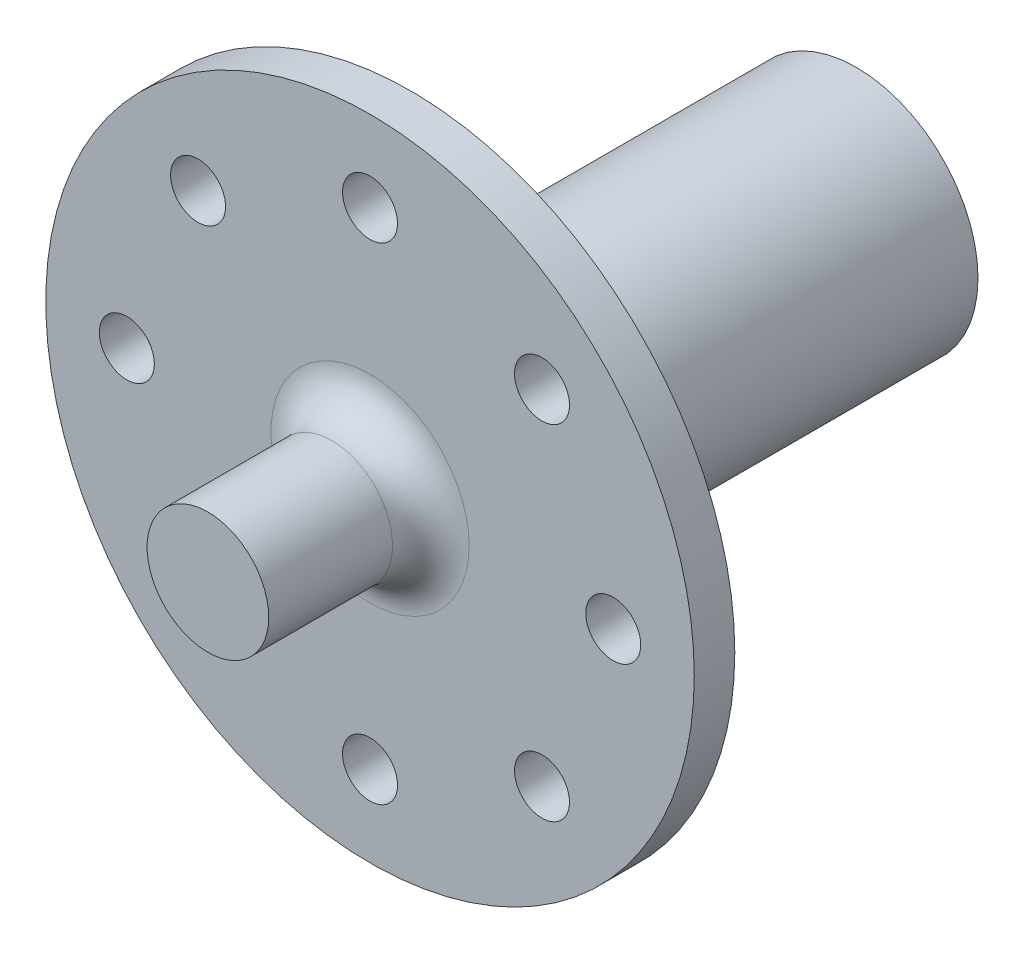
ISO-10303-21;
HEADER;
FILE_DESCRIPTION(('STEP AP214'),'2;1');
FILE_NAME('part.step','',(''),(''),'','','');
FILE_SCHEMA(('AUTOMOTIVE_DESIGN { 1 0 10303 214 1 1 1 1 }'));
ENDSEC;
DATA;
#1=APPLICATION_CONTEXT('core data for automotive mechanical design processes');
#2=APPLICATION_PROTOCOL_DEFINITION('international standard','automotive_design',2000,#1);
#3=PRODUCT_CONTEXT('',#1,'mechanical');
#4=PRODUCT('Part','Part','',(#3));
#5=PRODUCT_RELATED_PRODUCT_CATEGORY('part','',(#4));
#6=PRODUCT_DEFINITION_FORMATION('','',#4);
#7=PRODUCT_DEFINITION_CONTEXT('part definition',#1,'design');
#8=PRODUCT_DEFINITION('design','',#6,#7);
#9=PRODUCT_DEFINITION_SHAPE('','',#8);
#10=(LENGTH_UNIT() NAMED_UNIT(*) SI_UNIT(.MILLI.,.METRE.));
#11=(NAMED_UNIT(*) PLANE_ANGLE_UNIT() SI_UNIT($,.RADIAN.));
#12=(NAMED_UNIT(*) SI_UNIT($,.STERADIAN.) SOLID_ANGLE_UNIT());
#13=UNCERTAINTY_MEASURE_WITH_UNIT(LENGTH_MEASURE(1.E-05),#10,'distance_accuracy_value','');
#14=(GEOMETRIC_REPRESENTATION_CONTEXT(3) GLOBAL_UNCERTAINTY_ASSIGNED_CONTEXT((#13)) GLOBAL_UNIT_ASSIGNED_CONTEXT((#10,
#11,#12)) REPRESENTATION_CONTEXT('',''));
#15=CARTESIAN_POINT('',(0.,0.,0.));
#16=DIRECTION('',(0.,0.,1.));
#17=DIRECTION('',(1.,0.,0.));
#18=AXIS2_PLACEMENT_3D('',#15,#16,#17);
#19=CARTESIAN_POINT('',(0.,0.,34.925));
#20=DIRECTION('',(0.,0.,-1.));
#21=DIRECTION('',(-1.,0.,0.));
#22=AXIS2_PLACEMENT_3D('',#19,#20,#21);
#23=CYLINDRICAL_SURFACE('',#22,9.525);
#24=CARTESIAN_POINT('',(0.,0.,34.925));
#25=DIRECTION('',(0.,0.,1.));
#26=DIRECTION('',(1.,0.,0.));
#27=AXIS2_PLACEMENT_3D('',#24,#25,#26);
#28=CIRCLE('',#27,9.525);
#29=CARTESIAN_POINT('',(9.525,0.,34.925));
#30=VERTEX_POINT('',#29);
#31=EDGE_CURVE('E159',#30,#30,#28,.T.);
#32=ORIENTED_EDGE('',*,*,#31,.F.);
#33=EDGE_LOOP('',(#32));
#34=FACE_BOUND('',#33,.T.);
#35=CARTESIAN_POINT('',(0.,0.,0.));
#36=DIRECTION('',(0.,0.,1.));
#37=DIRECTION('',(1.,0.,0.));
#38=AXIS2_PLACEMENT_3D('',#35,#36,#37);
#39=CIRCLE('',#38,9.525);
#40=CARTESIAN_POINT('',(9.525,0.,0.));
#41=VERTEX_POINT('',#40);
#42=EDGE_CURVE('E156',#41,#41,#39,.T.);
#43=ORIENTED_EDGE('',*,*,#42,.T.);
#44=EDGE_LOOP('',(#43));
#45=FACE_BOUND('',#44,.T.);
#46=ADVANCED_FACE('F44',(#34,#45),#23,.T.);
#47=CARTESIAN_POINT('',(0.,0.,0.));
#48=DIRECTION('',(0.,0.,1.));
#49=DIRECTION('',(1.,0.,0.));
#50=AXIS2_PLACEMENT_3D('',#47,#48,#49);
#51=PLANE('',#50);
#52=CARTESIAN_POINT('',(0.,0.,0.));
#53=DIRECTION('',(0.,0.,-1.));
#54=DIRECTION('',(-1.,0.,0.));
#55=AXIS2_PLACEMENT_3D('',#52,#53,#54);
#56=CIRCLE('',#55,4.);
#57=CARTESIAN_POINT('',(1.5,3.70809924354783,0.));
#58=VERTEX_POINT('',#57);
#59=CARTESIAN_POINT('',(-1.5,3.70809924354783,0.));
#60=VERTEX_POINT('',#59);
#61=EDGE_CURVE('E94',#58,#60,#56,.T.);
#62=ORIENTED_EDGE('',*,*,#61,.F.);
#63=DIRECTION('',(0.,-1.,0.));
#64=VECTOR('',#63,1.);
#65=CARTESIAN_POINT('',(1.5,5.2,0.));
#66=LINE('',#65,#64);
#67=CARTESIAN_POINT('',(1.5,5.2,0.));
#68=VERTEX_POINT('',#67);
#69=EDGE_CURVE('E59',#68,#58,#66,.T.);
#70=ORIENTED_EDGE('',*,*,#69,.F.);
#71=DIRECTION('',(1.,0.,0.));
#72=VECTOR('',#71,1.);
#73=CARTESIAN_POINT('',(1.5,5.2,0.));
#74=LINE('',#73,#72);
#75=CARTESIAN_POINT('',(-1.5,5.2,0.));
#76=VERTEX_POINT('',#75);
#77=EDGE_CURVE('E110',#76,#68,#74,.T.);
#78=ORIENTED_EDGE('',*,*,#77,.F.);
#79=DIRECTION('',(0.,1.,0.));
#80=VECTOR('',#79,1.);
#81=CARTESIAN_POINT('',(-1.5,5.2,0.));
#82=LINE('',#81,#80);
#83=EDGE_CURVE('E116',#60,#76,#82,.T.);
#84=ORIENTED_EDGE('',*,*,#83,.F.);
#85=EDGE_LOOP('',(#62,#70,#78,#84));
#86=FACE_BOUND('',#85,.T.);
#87=ORIENTED_EDGE('',*,*,#42,.F.);
#88=EDGE_LOOP('',(#87));
#89=FACE_BOUND('',#88,.T.);
#90=ADVANCED_FACE('F205',(#86,#89),#51,.F.);
#91=CARTESIAN_POINT('',(0.,0.,38.1));
#92=DIRECTION('',(0.,0.,-1.));
#93=DIRECTION('',(-1.,0.,0.));
#94=AXIS2_PLACEMENT_3D('',#91,#92,#93);
#95=CYLINDRICAL_SURFACE('',#94,25.4);
#96=CARTESIAN_POINT('',(0.,0.,38.1));
#97=DIRECTION('',(0.,0.,1.));
#98=DIRECTION('',(1.,0.,0.));
#99=AXIS2_PLACEMENT_3D('',#96,#97,#98);
#100=CIRCLE('',#99,25.4);
#101=CARTESIAN_POINT('',(25.4,0.,38.1));
#102=VERTEX_POINT('',#101);
#103=EDGE_CURVE('E153',#102,#102,#100,.T.);
#104=ORIENTED_EDGE('',*,*,#103,.F.);
#105=EDGE_LOOP('',(#104));
#106=FACE_BOUND('',#105,.T.);
#107=CARTESIAN_POINT('',(0.,0.,34.925));
#108=DIRECTION('',(0.,0.,1.));
#109=DIRECTION('',(1.,0.,0.));
#110=AXIS2_PLACEMENT_3D('',#107,#108,#109);
#111=CIRCLE('',#110,25.4);
#112=CARTESIAN_POINT('',(25.4,0.,34.925));
#113=VERTEX_POINT('',#112);
#114=EDGE_CURVE('E152',#113,#113,#111,.T.);
#115=ORIENTED_EDGE('',*,*,#114,.T.);
#116=EDGE_LOOP('',(#115));
#117=FACE_BOUND('',#116,.T.);
#118=ADVANCED_FACE('F210',(#106,#117),#95,.T.);
#119=CARTESIAN_POINT('',(0.,0.,38.1));
#120=DIRECTION('',(0.,0.,1.));
#121=DIRECTION('',(1.,0.,0.));
#122=AXIS2_PLACEMENT_3D('',#119,#120,#121);
#123=PLANE('',#122);
#124=CARTESIAN_POINT('',(0.,0.,38.1));
#125=DIRECTION('',(0.,0.,1.));
#126=DIRECTION('',(1.,0.,0.));
#127=AXIS2_PLACEMENT_3D('',#124,#125,#126);
#128=CIRCLE('',#127,7.7625);
#129=CARTESIAN_POINT('',(7.7625,0.,38.1));
#130=VERTEX_POINT('',#129);
#131=EDGE_CURVE('E13',#130,#130,#128,.F.);
#132=ORIENTED_EDGE('',*,*,#131,.T.);
#133=EDGE_LOOP('',(#132));
#134=FACE_BOUND('',#133,.T.);
#135=CARTESIAN_POINT('',(-19.05,0.,38.1));
#136=DIRECTION('',(0.,0.,1.));
#137=DIRECTION('',(0.,1.,0.));
#138=AXIS2_PLACEMENT_3D('',#135,#136,#137);
#139=CIRCLE('',#138,2.15265);
#140=CARTESIAN_POINT('',(-19.05,2.15264999999993,38.1));
#141=VERTEX_POINT('',#140);
#142=EDGE_CURVE('E129',#141,#141,#139,.T.);
#143=ORIENTED_EDGE('',*,*,#142,.F.);
#144=EDGE_LOOP('',(#143));
#145=FACE_BOUND('',#144,.T.);
#146=CARTESIAN_POINT('',(-13.4703841816037,-13.4703841816038,38.1));
#147=DIRECTION('',(0.,0.,1.));
#148=DIRECTION('',(-0.707106781186551,0.707106781186544,0.));
#149=AXIS2_PLACEMENT_3D('',#146,#147,#148);
#150=CIRCLE('',#149,2.15265);
#151=CARTESIAN_POINT('',(-14.9925375941249,-11.9482307690826,38.1));
#152=VERTEX_POINT('',#151);
#153=EDGE_CURVE('E133',#152,#152,#150,.T.);
#154=ORIENTED_EDGE('',*,*,#153,.F.);
#155=EDGE_LOOP('',(#154));
#156=FACE_BOUND('',#155,.T.);
#157=CARTESIAN_POINT('',(0.,-19.05,38.1));
#158=DIRECTION('',(0.,0.,1.));
#159=DIRECTION('',(-1.,0.,0.));
#160=AXIS2_PLACEMENT_3D('',#157,#158,#159);
#161=CIRCLE('',#160,2.15265);
#162=CARTESIAN_POINT('',(-2.15265,-19.05,38.1));
#163=VERTEX_POINT('',#162);
#164=EDGE_CURVE('E136',#163,#163,#161,.T.);
#165=ORIENTED_EDGE('',*,*,#164,.F.);
#166=EDGE_LOOP('',(#165));
#167=FACE_BOUND('',#166,.T.);
#168=CARTESIAN_POINT('',(13.4703841816038,-13.4703841816036,38.1));
#169=DIRECTION('',(0.,0.,1.));
#170=DIRECTION('',(-0.707106781186541,-0.707106781186554,0.));
#171=AXIS2_PLACEMENT_3D('',#168,#169,#170);
#172=CIRCLE('',#171,2.15265);
#173=CARTESIAN_POINT('',(11.9482307690826,-14.9925375941248,38.1));
#174=VERTEX_POINT('',#173);
#175=EDGE_CURVE('E126',#174,#174,#172,.T.);
#176=ORIENTED_EDGE('',*,*,#175,.F.);
#177=EDGE_LOOP('',(#176));
#178=FACE_BOUND('',#177,.T.);
#179=CARTESIAN_POINT('',(19.05,1.99538158514885E-13,38.1));
#180=DIRECTION('',(0.,0.,1.));
#181=DIRECTION('',(0.,-1.,0.));
#182=AXIS2_PLACEMENT_3D('',#179,#180,#181);
#183=CIRCLE('',#182,2.15265);
#184=CARTESIAN_POINT('',(19.05,-2.1526499999998,38.1));
#185=VERTEX_POINT('',#184);
#186=EDGE_CURVE('E123',#185,#185,#183,.T.);
#187=ORIENTED_EDGE('',*,*,#186,.F.);
#188=EDGE_LOOP('',(#187));
#189=FACE_BOUND('',#188,.T.);
#190=CARTESIAN_POINT('',(13.4703841816036,13.4703841816039,38.1));
#191=DIRECTION('',(0.,0.,1.));
#192=DIRECTION('',(0.707106781186556,-0.707106781186539,0.));
#193=AXIS2_PLACEMENT_3D('',#190,#191,#192);
#194=CIRCLE('',#193,2.15265);
#195=CARTESIAN_POINT('',(14.9925375941248,11.9482307690827,38.1));
#196=VERTEX_POINT('',#195);
#197=EDGE_CURVE('E120',#196,#196,#194,.T.);
#198=ORIENTED_EDGE('',*,*,#197,.F.);
#199=EDGE_LOOP('',(#198));
#200=FACE_BOUND('',#199,.T.);
#201=CARTESIAN_POINT('',(-13.4703841816038,13.4703841816037,38.1));
#202=DIRECTION('',(0.,0.,1.));
#203=DIRECTION('',(0.707106781186546,0.707106781186549,0.));
#204=AXIS2_PLACEMENT_3D('',#201,#202,#203);
#205=CIRCLE('',#204,2.15265);
#206=CARTESIAN_POINT('',(-11.9482307690825,14.9925375941249,38.1));
#207=VERTEX_POINT('',#206);
#208=EDGE_CURVE('E132',#207,#207,#205,.T.);
#209=ORIENTED_EDGE('',*,*,#208,.F.);
#210=EDGE_LOOP('',(#209));
#211=FACE_BOUND('',#210,.T.);
#212=CARTESIAN_POINT('',(0.,19.05,38.1));
#213=DIRECTION('',(0.,0.,1.));
#214=DIRECTION('',(1.,0.,0.));
#215=AXIS2_PLACEMENT_3D('',#212,#213,#214);
#216=CIRCLE('',#215,2.15265);
#217=CARTESIAN_POINT('',(2.15265,19.05,38.1));
#218=VERTEX_POINT('',#217);
#219=EDGE_CURVE('E144',#218,#218,#216,.T.);
#220=ORIENTED_EDGE('',*,*,#219,.F.);
#221=EDGE_LOOP('',(#220));
#222=FACE_BOUND('',#221,.T.);
#223=ORIENTED_EDGE('',*,*,#103,.T.);
#224=EDGE_LOOP('',(#223));
#225=FACE_BOUND('',#224,.T.);
#226=ADVANCED_FACE('F218',(#134,#145,#156,#167,#178,#189,#200,#211,#222,#225),#123,.T.);
#227=CARTESIAN_POINT('',(0.,0.,34.925));
#228=DIRECTION('',(0.,0.,1.));
#229=DIRECTION('',(1.,0.,0.));
#230=AXIS2_PLACEMENT_3D('',#227,#228,#229);
#231=PLANE('',#230);
#232=CARTESIAN_POINT('',(-19.05,0.,34.925));
#233=DIRECTION('',(0.,0.,1.));
#234=DIRECTION('',(1.,0.,0.));
#235=AXIS2_PLACEMENT_3D('',#232,#233,#234);
#236=CIRCLE('',#235,2.15265);
#237=CARTESIAN_POINT('',(-16.89735,0.,34.925));
#238=VERTEX_POINT('',#237);
#239=EDGE_CURVE('E148',#238,#238,#236,.T.);
#240=ORIENTED_EDGE('',*,*,#239,.T.);
#241=EDGE_LOOP('',(#240));
#242=FACE_BOUND('',#241,.T.);
#243=CARTESIAN_POINT('',(-13.4703841816037,-13.4703841816038,34.925));
#244=DIRECTION('',(0.,0.,1.));
#245=DIRECTION('',(1.,0.,0.));
#246=AXIS2_PLACEMENT_3D('',#243,#244,#245);
#247=CIRCLE('',#246,2.15265);
#248=CARTESIAN_POINT('',(-11.3177341816037,-13.4703841816038,34.925));
#249=VERTEX_POINT('',#248);
#250=EDGE_CURVE('E180',#249,#249,#247,.T.);
#251=ORIENTED_EDGE('',*,*,#250,.T.);
#252=EDGE_LOOP('',(#251));
#253=FACE_BOUND('',#252,.T.);
#254=CARTESIAN_POINT('',(0.,-19.05,34.925));
#255=DIRECTION('',(0.,0.,1.));
#256=DIRECTION('',(1.,0.,0.));
#257=AXIS2_PLACEMENT_3D('',#254,#255,#256);
#258=CIRCLE('',#257,2.15265);
#259=CARTESIAN_POINT('',(2.15265,-19.05,34.925));
#260=VERTEX_POINT('',#259);
#261=EDGE_CURVE('E177',#260,#260,#258,.T.);
#262=ORIENTED_EDGE('',*,*,#261,.T.);
#263=EDGE_LOOP('',(#262));
#264=FACE_BOUND('',#263,.T.);
#265=CARTESIAN_POINT('',(13.4703841816038,-13.4703841816036,34.925));
#266=DIRECTION('',(0.,0.,1.));
#267=DIRECTION('',(1.,0.,0.));
#268=AXIS2_PLACEMENT_3D('',#265,#266,#267);
#269=CIRCLE('',#268,2.15265);
#270=CARTESIAN_POINT('',(15.6230341816038,-13.4703841816036,34.925));
#271=VERTEX_POINT('',#270);
#272=EDGE_CURVE('E174',#271,#271,#269,.T.);
#273=ORIENTED_EDGE('',*,*,#272,.T.);
#274=EDGE_LOOP('',(#273));
#275=FACE_BOUND('',#274,.T.);
#276=CARTESIAN_POINT('',(19.05,1.99538158514885E-13,34.925));
#277=DIRECTION('',(0.,0.,1.));
#278=DIRECTION('',(1.,0.,0.));
#279=AXIS2_PLACEMENT_3D('',#276,#277,#278);
#280=CIRCLE('',#279,2.15265);
#281=CARTESIAN_POINT('',(21.20265,1.99538158514885E-13,34.925));
#282=VERTEX_POINT('',#281);
#283=EDGE_CURVE('E171',#282,#282,#280,.T.);
#284=ORIENTED_EDGE('',*,*,#283,.T.);
#285=EDGE_LOOP('',(#284));
#286=FACE_BOUND('',#285,.T.);
#287=CARTESIAN_POINT('',(13.4703841816036,13.4703841816039,34.925));
#288=DIRECTION('',(0.,0.,1.));
#289=DIRECTION('',(1.,0.,0.));
#290=AXIS2_PLACEMENT_3D('',#287,#288,#289);
#291=CIRCLE('',#290,2.15265);
#292=CARTESIAN_POINT('',(15.6230341816036,13.4703841816039,34.925));
#293=VERTEX_POINT('',#292);
#294=EDGE_CURVE('E168',#293,#293,#291,.T.);
#295=ORIENTED_EDGE('',*,*,#294,.T.);
#296=EDGE_LOOP('',(#295));
#297=FACE_BOUND('',#296,.T.);
#298=CARTESIAN_POINT('',(-13.4703841816038,13.4703841816037,34.925));
#299=DIRECTION('',(0.,0.,1.));
#300=DIRECTION('',(1.,0.,0.));
#301=AXIS2_PLACEMENT_3D('',#298,#299,#300);
#302=CIRCLE('',#301,2.15265);
#303=CARTESIAN_POINT('',(-11.3177341816038,13.4703841816037,34.925));
#304=VERTEX_POINT('',#303);
#305=EDGE_CURVE('E143',#304,#304,#302,.T.);
#306=ORIENTED_EDGE('',*,*,#305,.T.);
#307=EDGE_LOOP('',(#306));
#308=FACE_BOUND('',#307,.T.);
#309=CARTESIAN_POINT('',(0.,19.05,34.925));
#310=DIRECTION('',(0.,0.,1.));
#311=DIRECTION('',(1.,0.,0.));
#312=AXIS2_PLACEMENT_3D('',#309,#310,#311);
#313=CIRCLE('',#312,2.15265);
#314=CARTESIAN_POINT('',(2.15265,19.05,34.925));
#315=VERTEX_POINT('',#314);
#316=EDGE_CURVE('E147',#315,#315,#313,.T.);
#317=ORIENTED_EDGE('',*,*,#316,.T.);
#318=EDGE_LOOP('',(#317));
#319=FACE_BOUND('',#318,.T.);
#320=ORIENTED_EDGE('',*,*,#31,.T.);
#321=EDGE_LOOP('',(#320));
#322=FACE_BOUND('',#321,.T.);
#323=ORIENTED_EDGE('',*,*,#114,.F.);
#324=EDGE_LOOP('',(#323));
#325=FACE_BOUND('',#324,.T.);
#326=ADVANCED_FACE('F220',(#242,#253,#264,#275,#286,#297,#308,#319,#322,#325),#231,.F.);
#327=CARTESIAN_POINT('',(0.,0.,50.8));
#328=DIRECTION('',(0.,0.,-1.));
#329=DIRECTION('',(-1.,0.,0.));
#330=AXIS2_PLACEMENT_3D('',#327,#328,#329);
#331=CYLINDRICAL_SURFACE('',#330,4.7625);
#332=CARTESIAN_POINT('',(0.,0.,41.1));
#333=DIRECTION('',(0.,0.,1.));
#334=DIRECTION('',(1.,0.,0.));
#335=AXIS2_PLACEMENT_3D('',#332,#333,#334);
#336=CIRCLE('',#335,4.7625);
#337=CARTESIAN_POINT('',(4.7625,0.,41.1));
#338=VERTEX_POINT('',#337);
#339=EDGE_CURVE('E52',#338,#338,#336,.T.);
#340=ORIENTED_EDGE('',*,*,#339,.T.);
#341=EDGE_LOOP('',(#340));
#342=FACE_BOUND('',#341,.T.);
#343=CARTESIAN_POINT('',(0.,0.,50.8));
#344=DIRECTION('',(0.,0.,1.));
#345=DIRECTION('',(1.,0.,0.));
#346=AXIS2_PLACEMENT_3D('',#343,#344,#345);
#347=CIRCLE('',#346,4.7625);
#348=CARTESIAN_POINT('',(4.7625,0.,50.8));
#349=VERTEX_POINT('',#348);
#350=EDGE_CURVE('E149',#349,#349,#347,.T.);
#351=ORIENTED_EDGE('',*,*,#350,.F.);
#352=EDGE_LOOP('',(#351));
#353=FACE_BOUND('',#352,.T.);
#354=ADVANCED_FACE('F187',(#342,#353),#331,.T.);
#355=CARTESIAN_POINT('',(0.,0.,50.8));
#356=DIRECTION('',(0.,0.,1.));
#357=DIRECTION('',(1.,0.,0.));
#358=AXIS2_PLACEMENT_3D('',#355,#356,#357);
#359=PLANE('',#358);
#360=ORIENTED_EDGE('',*,*,#350,.T.);
#361=EDGE_LOOP('',(#360));
#362=FACE_BOUND('',#361,.T.);
#363=ADVANCED_FACE('F229',(#362),#359,.T.);
#364=CARTESIAN_POINT('',(0.,19.05,19.05));
#365=DIRECTION('',(0.,0.,1.));
#366=DIRECTION('',(1.,0.,0.));
#367=AXIS2_PLACEMENT_3D('',#364,#365,#366);
#368=CYLINDRICAL_SURFACE('',#367,2.15265);
#369=ORIENTED_EDGE('',*,*,#219,.T.);
#370=EDGE_LOOP('',(#369));
#371=FACE_BOUND('',#370,.T.);
#372=ORIENTED_EDGE('',*,*,#316,.F.);
#373=EDGE_LOOP('',(#372));
#374=FACE_BOUND('',#373,.T.);
#375=ADVANCED_FACE('F232',(#371,#374),#368,.F.);
#376=CARTESIAN_POINT('',(-13.4703841816038,13.4703841816037,19.05));
#377=DIRECTION('',(0.,0.,1.));
#378=DIRECTION('',(1.,0.,0.));
#379=AXIS2_PLACEMENT_3D('',#376,#377,#378);
#380=CYLINDRICAL_SURFACE('',#379,2.15265);
#381=ORIENTED_EDGE('',*,*,#208,.T.);
#382=EDGE_LOOP('',(#381));
#383=FACE_BOUND('',#382,.T.);
#384=ORIENTED_EDGE('',*,*,#305,.F.);
#385=EDGE_LOOP('',(#384));
#386=FACE_BOUND('',#385,.T.);
#387=ADVANCED_FACE('F236',(#383,#386),#380,.F.);
#388=CARTESIAN_POINT('',(13.4703841816036,13.4703841816039,19.05));
#389=DIRECTION('',(0.,0.,1.));
#390=DIRECTION('',(1.,0.,0.));
#391=AXIS2_PLACEMENT_3D('',#388,#389,#390);
#392=CYLINDRICAL_SURFACE('',#391,2.15265);
#393=ORIENTED_EDGE('',*,*,#197,.T.);
#394=EDGE_LOOP('',(#393));
#395=FACE_BOUND('',#394,.T.);
#396=ORIENTED_EDGE('',*,*,#294,.F.);
#397=EDGE_LOOP('',(#396));
#398=FACE_BOUND('',#397,.T.);
#399=ADVANCED_FACE('F240',(#395,#398),#392,.F.);
#400=CARTESIAN_POINT('',(19.05,1.99538158514885E-13,19.05));
#401=DIRECTION('',(0.,0.,1.));
#402=DIRECTION('',(1.,0.,0.));
#403=AXIS2_PLACEMENT_3D('',#400,#401,#402);
#404=CYLINDRICAL_SURFACE('',#403,2.15265);
#405=ORIENTED_EDGE('',*,*,#186,.T.);
#406=EDGE_LOOP('',(#405));
#407=FACE_BOUND('',#406,.T.);
#408=ORIENTED_EDGE('',*,*,#283,.F.);
#409=EDGE_LOOP('',(#408));
#410=FACE_BOUND('',#409,.T.);
#411=ADVANCED_FACE('F246',(#407,#410),#404,.F.);
#412=CARTESIAN_POINT('',(13.4703841816038,-13.4703841816036,19.05));
#413=DIRECTION('',(0.,0.,1.));
#414=DIRECTION('',(1.,0.,0.));
#415=AXIS2_PLACEMENT_3D('',#412,#413,#414);
#416=CYLINDRICAL_SURFACE('',#415,2.15265);
#417=ORIENTED_EDGE('',*,*,#175,.T.);
#418=EDGE_LOOP('',(#417));
#419=FACE_BOUND('',#418,.T.);
#420=ORIENTED_EDGE('',*,*,#272,.F.);
#421=EDGE_LOOP('',(#420));
#422=FACE_BOUND('',#421,.T.);
#423=ADVANCED_FACE('F242',(#419,#422),#416,.F.);
#424=CARTESIAN_POINT('',(0.,-19.05,19.05));
#425=DIRECTION('',(0.,0.,1.));
#426=DIRECTION('',(1.,0.,0.));
#427=AXIS2_PLACEMENT_3D('',#424,#425,#426);
#428=CYLINDRICAL_SURFACE('',#427,2.15265);
#429=ORIENTED_EDGE('',*,*,#164,.T.);
#430=EDGE_LOOP('',(#429));
#431=FACE_BOUND('',#430,.T.);
#432=ORIENTED_EDGE('',*,*,#261,.F.);
#433=EDGE_LOOP('',(#432));
#434=FACE_BOUND('',#433,.T.);
#435=ADVANCED_FACE('F245',(#431,#434),#428,.F.);
#436=CARTESIAN_POINT('',(-13.4703841816037,-13.4703841816038,19.05));
#437=DIRECTION('',(0.,0.,1.));
#438=DIRECTION('',(1.,0.,0.));
#439=AXIS2_PLACEMENT_3D('',#436,#437,#438);
#440=CYLINDRICAL_SURFACE('',#439,2.15265);
#441=ORIENTED_EDGE('',*,*,#153,.T.);
#442=EDGE_LOOP('',(#441));
#443=FACE_BOUND('',#442,.T.);
#444=ORIENTED_EDGE('',*,*,#250,.F.);
#445=EDGE_LOOP('',(#444));
#446=FACE_BOUND('',#445,.T.);
#447=ADVANCED_FACE('F200',(#443,#446),#440,.F.);
#448=CARTESIAN_POINT('',(-19.05,0.,19.05));
#449=DIRECTION('',(0.,0.,1.));
#450=DIRECTION('',(1.,0.,0.));
#451=AXIS2_PLACEMENT_3D('',#448,#449,#450);
#452=CYLINDRICAL_SURFACE('',#451,2.15265);
#453=ORIENTED_EDGE('',*,*,#142,.T.);
#454=EDGE_LOOP('',(#453));
#455=FACE_BOUND('',#454,.T.);
#456=ORIENTED_EDGE('',*,*,#239,.F.);
#457=EDGE_LOOP('',(#456));
#458=FACE_BOUND('',#457,.T.);
#459=ADVANCED_FACE('F192',(#455,#458),#452,.F.);
#460=CARTESIAN_POINT('',(0.,0.,41.1));
#461=DIRECTION('',(0.,0.,1.));
#462=DIRECTION('',(1.,0.,0.));
#463=AXIS2_PLACEMENT_3D('',#460,#461,#462);
#464=TOROIDAL_SURFACE('',#463,7.7625,3.);
#465=ORIENTED_EDGE('',*,*,#131,.F.);
#466=EDGE_LOOP('',(#465));
#467=FACE_BOUND('',#466,.T.);
#468=ORIENTED_EDGE('',*,*,#339,.F.);
#469=EDGE_LOOP('',(#468));
#470=FACE_BOUND('',#469,.T.);
#471=ADVANCED_FACE('F46',(#467,#470),#464,.F.);
#472=CARTESIAN_POINT('',(1.5,5.2,17.1500038));
#473=DIRECTION('',(1.,0.,0.));
#474=DIRECTION('',(0.,1.,0.));
#475=AXIS2_PLACEMENT_3D('',#472,#473,#474);
#476=PLANE('',#475);
#477=ORIENTED_EDGE('',*,*,#69,.T.);
#478=DIRECTION('',(0.,0.,-1.));
#479=VECTOR('',#478,1.);
#480=CARTESIAN_POINT('',(1.5,3.70809924354783,17.1500038));
#481=LINE('',#480,#479);
#482=CARTESIAN_POINT('',(1.5,3.70809924354783,17.1500038));
#483=VERTEX_POINT('',#482);
#484=EDGE_CURVE('E82',#483,#58,#481,.T.);
#485=ORIENTED_EDGE('',*,*,#484,.F.);
#486=DIRECTION('',(0.,-1.,0.));
#487=VECTOR('',#486,1.);
#488=CARTESIAN_POINT('',(1.5,5.2,17.1500038));
#489=LINE('',#488,#487);
#490=CARTESIAN_POINT('',(1.5,5.2,17.1500038));
#491=VERTEX_POINT('',#490);
#492=EDGE_CURVE('E108',#491,#483,#489,.T.);
#493=ORIENTED_EDGE('',*,*,#492,.F.);
#494=DIRECTION('',(0.,0.,-1.));
#495=VECTOR('',#494,1.);
#496=CARTESIAN_POINT('',(1.5,5.2,17.1500038));
#497=LINE('',#496,#495);
#498=EDGE_CURVE('E67',#491,#68,#497,.T.);
#499=ORIENTED_EDGE('',*,*,#498,.T.);
#500=EDGE_LOOP('',(#477,#485,#493,#499));
#501=FACE_BOUND('',#500,.T.);
#502=ADVANCED_FACE('F191',(#501),#476,.F.);
#503=CARTESIAN_POINT('',(1.5,5.2,17.1500038));
#504=DIRECTION('',(0.,1.,0.));
#505=DIRECTION('',(0.,0.,1.));
#506=AXIS2_PLACEMENT_3D('',#503,#504,#505);
#507=PLANE('',#506);
#508=ORIENTED_EDGE('',*,*,#77,.T.);
#509=ORIENTED_EDGE('',*,*,#498,.F.);
#510=DIRECTION('',(1.,0.,0.));
#511=VECTOR('',#510,1.);
#512=CARTESIAN_POINT('',(1.5,5.2,17.1500038));
#513=LINE('',#512,#511);
#514=CARTESIAN_POINT('',(-1.5,5.2,17.1500038));
#515=VERTEX_POINT('',#514);
#516=EDGE_CURVE('E105',#515,#491,#513,.T.);
#517=ORIENTED_EDGE('',*,*,#516,.F.);
#518=DIRECTION('',(0.,0.,-1.));
#519=VECTOR('',#518,1.);
#520=CARTESIAN_POINT('',(-1.5,5.2,17.1500038));
#521=LINE('',#520,#519);
#522=EDGE_CURVE('E98',#515,#76,#521,.T.);
#523=ORIENTED_EDGE('',*,*,#522,.T.);
#524=EDGE_LOOP('',(#508,#509,#517,#523));
#525=FACE_BOUND('',#524,.T.);
#526=ADVANCED_FACE('F198',(#525),#507,.F.);
#527=CARTESIAN_POINT('',(-1.5,5.2,17.1500038));
#528=DIRECTION('',(-1.,0.,0.));
#529=DIRECTION('',(0.,-1.,0.));
#530=AXIS2_PLACEMENT_3D('',#527,#528,#529);
#531=PLANE('',#530);
#532=ORIENTED_EDGE('',*,*,#83,.T.);
#533=ORIENTED_EDGE('',*,*,#522,.F.);
#534=DIRECTION('',(0.,1.,0.));
#535=VECTOR('',#534,1.);
#536=CARTESIAN_POINT('',(-1.5,5.2,17.1500038));
#537=LINE('',#536,#535);
#538=CARTESIAN_POINT('',(-1.5,3.70809924354783,17.1500038));
#539=VERTEX_POINT('',#538);
#540=EDGE_CURVE('E101',#539,#515,#537,.T.);
#541=ORIENTED_EDGE('',*,*,#540,.F.);
#542=DIRECTION('',(0.,0.,-1.));
#543=VECTOR('',#542,1.);
#544=CARTESIAN_POINT('',(-1.5,3.70809924354783,17.1500038));
#545=LINE('',#544,#543);
#546=EDGE_CURVE('E87',#539,#60,#545,.T.);
#547=ORIENTED_EDGE('',*,*,#546,.T.);
#548=EDGE_LOOP('',(#532,#533,#541,#547));
#549=FACE_BOUND('',#548,.T.);
#550=ADVANCED_FACE('F102',(#549),#531,.F.);
#551=CARTESIAN_POINT('',(0.,0.,17.1500038));
#552=DIRECTION('',(0.,0.,-1.));
#553=DIRECTION('',(-1.,0.,0.));
#554=AXIS2_PLACEMENT_3D('',#551,#552,#553);
#555=CYLINDRICAL_SURFACE('',#554,4.);
#556=ORIENTED_EDGE('',*,*,#61,.T.);
#557=ORIENTED_EDGE('',*,*,#546,.F.);
#558=CARTESIAN_POINT('',(0.,0.,17.1500038));
#559=DIRECTION('',(0.,0.,-1.));
#560=DIRECTION('',(-1.,0.,0.));
#561=AXIS2_PLACEMENT_3D('',#558,#559,#560);
#562=CIRCLE('',#561,4.);
#563=EDGE_CURVE('E91',#483,#539,#562,.T.);
#564=ORIENTED_EDGE('',*,*,#563,.F.);
#565=ORIENTED_EDGE('',*,*,#484,.T.);
#566=EDGE_LOOP('',(#556,#557,#564,#565));
#567=FACE_BOUND('',#566,.T.);
#568=ADVANCED_FACE('F89',(#567),#555,.F.);
#569=CARTESIAN_POINT('',(0.,0.,17.1500038));
#570=DIRECTION('',(0.,0.,-1.));
#571=DIRECTION('',(-1.,0.,0.));
#572=AXIS2_PLACEMENT_3D('',#569,#570,#571);
#573=PLANE('',#572);
#574=ORIENTED_EDGE('',*,*,#492,.T.);
#575=ORIENTED_EDGE('',*,*,#563,.T.);
#576=ORIENTED_EDGE('',*,*,#540,.T.);
#577=ORIENTED_EDGE('',*,*,#516,.T.);
#578=EDGE_LOOP('',(#574,#575,#576,#577));
#579=FACE_BOUND('',#578,.T.);
#580=ADVANCED_FACE('F107',(#579),#573,.T.);
#581=CLOSED_SHELL('',(#46,#90,#118,#226,#326,#354,#363,#375,#387,#399,#411,#423,#435,#447,#459,
#471,#502,#526,#550,#568,#580));
#582=MANIFOLD_SOLID_BREP('B2',#581);
#583=ADVANCED_BREP_SHAPE_REPRESENTATION('',(#18,#582),#14);
#584=SHAPE_DEFINITION_REPRESENTATION(#9,#583);
ENDSEC;
END-ISO-10303-21;
